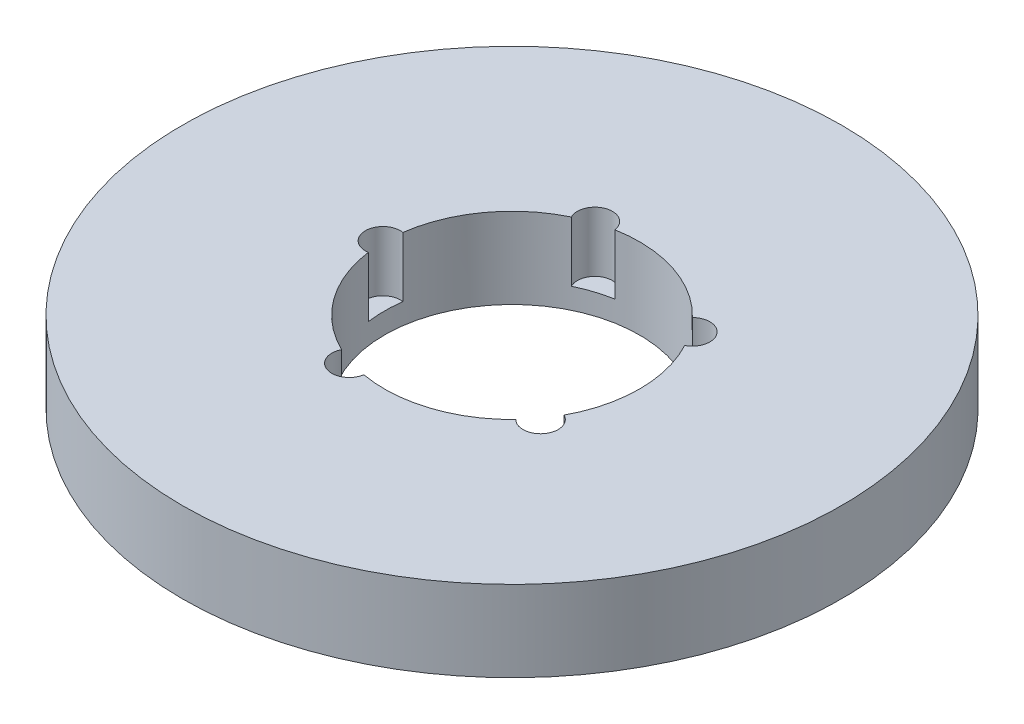
ISO-10303-21;
HEADER;
FILE_DESCRIPTION(('STEP AP214'),'2;1');
FILE_NAME('part.step','',(''),(''),'','','');
FILE_SCHEMA(('AUTOMOTIVE_DESIGN { 1 0 10303 214 1 1 1 1 }'));
ENDSEC;
DATA;
#1=APPLICATION_CONTEXT('core data for automotive mechanical design processes');
#2=APPLICATION_PROTOCOL_DEFINITION('international standard','automotive_design',2000,#1);
#3=PRODUCT_CONTEXT('',#1,'mechanical');
#4=PRODUCT('Part','Part','',(#3));
#5=PRODUCT_RELATED_PRODUCT_CATEGORY('part','',(#4));
#6=PRODUCT_DEFINITION_FORMATION('','',#4);
#7=PRODUCT_DEFINITION_CONTEXT('part definition',#1,'design');
#8=PRODUCT_DEFINITION('design','',#6,#7);
#9=PRODUCT_DEFINITION_SHAPE('','',#8);
#10=(LENGTH_UNIT() NAMED_UNIT(*) SI_UNIT(.MILLI.,.METRE.));
#11=(NAMED_UNIT(*) PLANE_ANGLE_UNIT() SI_UNIT($,.RADIAN.));
#12=(NAMED_UNIT(*) SI_UNIT($,.STERADIAN.) SOLID_ANGLE_UNIT());
#13=UNCERTAINTY_MEASURE_WITH_UNIT(LENGTH_MEASURE(1.E-05),#10,'distance_accuracy_value','');
#14=(GEOMETRIC_REPRESENTATION_CONTEXT(3) GLOBAL_UNCERTAINTY_ASSIGNED_CONTEXT((#13)) GLOBAL_UNIT_ASSIGNED_CONTEXT((#10,
#11,#12)) REPRESENTATION_CONTEXT('',''));
#15=CARTESIAN_POINT('',(0.,0.,0.));
#16=DIRECTION('',(0.,0.,1.));
#17=DIRECTION('',(1.,0.,0.));
#18=AXIS2_PLACEMENT_3D('',#15,#16,#17);
#19=CARTESIAN_POINT('',(0.,19.,0.));
#20=DIRECTION('',(0.,-1.,0.));
#21=DIRECTION('',(0.,0.,-1.));
#22=AXIS2_PLACEMENT_3D('',#19,#20,#21);
#23=CYLINDRICAL_SURFACE('',#22,77.5);
#24=CARTESIAN_POINT('',(0.,19.,0.));
#25=DIRECTION('',(0.,1.,0.));
#26=DIRECTION('',(0.,0.,1.));
#27=AXIS2_PLACEMENT_3D('',#24,#25,#26);
#28=CIRCLE('',#27,77.5);
#29=CARTESIAN_POINT('',(0.,19.,77.5));
#30=VERTEX_POINT('',#29);
#31=EDGE_CURVE('E160',#30,#30,#28,.T.);
#32=ORIENTED_EDGE('',*,*,#31,.F.);
#33=EDGE_LOOP('',(#32));
#34=FACE_BOUND('',#33,.T.);
#35=CARTESIAN_POINT('',(0.,0.,0.));
#36=DIRECTION('',(0.,1.,0.));
#37=DIRECTION('',(0.,0.,1.));
#38=AXIS2_PLACEMENT_3D('',#35,#36,#37);
#39=CIRCLE('',#38,77.5);
#40=CARTESIAN_POINT('',(0.,0.,77.5));
#41=VERTEX_POINT('',#40);
#42=EDGE_CURVE('E153',#41,#41,#39,.T.);
#43=ORIENTED_EDGE('',*,*,#42,.T.);
#44=EDGE_LOOP('',(#43));
#45=FACE_BOUND('',#44,.T.);
#46=ADVANCED_FACE('F39',(#34,#45),#23,.T.);
#47=CARTESIAN_POINT('',(0.,19.,0.));
#48=DIRECTION('',(0.,1.,0.));
#49=DIRECTION('',(0.,0.,1.));
#50=AXIS2_PLACEMENT_3D('',#47,#48,#49);
#51=PLANE('',#50);
#52=CARTESIAN_POINT('',(-9.3824829116188,19.,28.8763131949176));
#53=DIRECTION('',(0.,1.,0.));
#54=DIRECTION('',(0.951056516295155,0.,0.309016994374945));
#55=AXIS2_PLACEMENT_3D('',#52,#53,#54);
#56=CIRCLE('',#55,4.11929126151412);
#57=CARTESIAN_POINT('',(-13.0549902183955,19.,27.0105022240905));
#58=VERTEX_POINT('',#57);
#59=CARTESIAN_POINT('',(-5.31466591625265,19.,29.5254860450869));
#60=VERTEX_POINT('',#59);
#61=EDGE_CURVE('E186',#58,#60,#56,.T.);
#62=ORIENTED_EDGE('',*,*,#61,.F.);
#63=CARTESIAN_POINT('',(0.,19.,0.));
#64=DIRECTION('',(0.,1.,0.));
#65=DIRECTION('',(0.,0.,1.));
#66=AXIS2_PLACEMENT_3D('',#63,#64,#65);
#67=CIRCLE('',#66,30.);
#68=CARTESIAN_POINT('',(-29.7227279875089,19.,4.06932930352829));
#69=VERTEX_POINT('',#68);
#70=EDGE_CURVE('E148',#69,#58,#67,.T.);
#71=ORIENTED_EDGE('',*,*,#70,.F.);
#72=CARTESIAN_POINT('',(-30.3623524997288,19.,0.));
#73=DIRECTION('',(0.,1.,0.));
#74=DIRECTION('',(0.,0.,1.));
#75=AXIS2_PLACEMENT_3D('',#72,#73,#74);
#76=CIRCLE('',#75,4.11929126151412);
#77=CARTESIAN_POINT('',(-29.7227279875089,19.,-4.06932930352829));
#78=VERTEX_POINT('',#77);
#79=EDGE_CURVE('E142',#78,#69,#76,.T.);
#80=ORIENTED_EDGE('',*,*,#79,.F.);
#81=CARTESIAN_POINT('',(-13.0549902183958,19.,-27.0105022240903));
#82=VERTEX_POINT('',#81);
#83=EDGE_CURVE('E132',#82,#78,#67,.T.);
#84=ORIENTED_EDGE('',*,*,#83,.F.);
#85=CARTESIAN_POINT('',(-9.3824829116192,19.,-28.8763131949174));
#86=DIRECTION('',(0.,1.,0.));
#87=DIRECTION('',(-0.95105651629515,0.,0.309016994374958));
#88=AXIS2_PLACEMENT_3D('',#85,#86,#87);
#89=CIRCLE('',#88,4.11929126151412);
#90=CARTESIAN_POINT('',(-5.31466591625307,19.,-29.5254860450868));
#91=VERTEX_POINT('',#90);
#92=EDGE_CURVE('E111',#91,#82,#89,.T.);
#93=ORIENTED_EDGE('',*,*,#92,.F.);
#94=CARTESIAN_POINT('',(21.6543003097429,19.,-20.762737731221));
#95=VERTEX_POINT('',#94);
#96=EDGE_CURVE('E141',#95,#91,#67,.T.);
#97=ORIENTED_EDGE('',*,*,#96,.F.);
#98=CARTESIAN_POINT('',(24.5636591614831,19.,-17.8465430242463));
#99=DIRECTION('',(0.,1.,0.));
#100=DIRECTION('',(-0.58778525229248,0.,-0.809016994374942));
#101=AXIS2_PLACEMENT_3D('',#98,#99,#100);
#102=CIRCLE('',#101,4.11929126151412);
#103=CARTESIAN_POINT('',(26.438083812414,19.,-14.1784246066964));
#104=VERTEX_POINT('',#103);
#105=EDGE_CURVE('E173',#104,#95,#102,.T.);
#106=ORIENTED_EDGE('',*,*,#105,.F.);
#107=CARTESIAN_POINT('',(26.4380838124142,19.,14.178424606696));
#108=VERTEX_POINT('',#107);
#109=EDGE_CURVE('E150',#108,#104,#67,.T.);
#110=ORIENTED_EDGE('',*,*,#109,.F.);
#111=CARTESIAN_POINT('',(24.5636591614834,19.,17.846543024246));
#112=DIRECTION('',(0.,1.,0.));
#113=DIRECTION('',(0.587785252292469,0.,-0.809016994374951));
#114=AXIS2_PLACEMENT_3D('',#111,#112,#113);
#115=CIRCLE('',#114,4.11929126151412);
#116=CARTESIAN_POINT('',(21.6543003097432,19.,20.7627377312207));
#117=VERTEX_POINT('',#116);
#118=EDGE_CURVE('E172',#117,#108,#115,.T.);
#119=ORIENTED_EDGE('',*,*,#118,.F.);
#120=EDGE_CURVE('E152',#60,#117,#67,.T.);
#121=ORIENTED_EDGE('',*,*,#120,.F.);
#122=EDGE_LOOP('',(#62,#71,#80,#84,#93,#97,#106,#110,#119,#121));
#123=FACE_BOUND('',#122,.T.);
#124=ORIENTED_EDGE('',*,*,#31,.T.);
#125=EDGE_LOOP('',(#124));
#126=FACE_BOUND('',#125,.T.);
#127=ADVANCED_FACE('F138',(#123,#126),#51,.T.);
#128=CARTESIAN_POINT('',(0.,0.,0.));
#129=DIRECTION('',(0.,1.,0.));
#130=DIRECTION('',(0.,0.,1.));
#131=AXIS2_PLACEMENT_3D('',#128,#129,#130);
#132=PLANE('',#131);
#133=CARTESIAN_POINT('',(0.,0.,0.));
#134=DIRECTION('',(0.,1.,0.));
#135=DIRECTION('',(0.,0.,1.));
#136=AXIS2_PLACEMENT_3D('',#133,#134,#135);
#137=CIRCLE('',#136,30.);
#138=CARTESIAN_POINT('',(0.,0.,30.));
#139=VERTEX_POINT('',#138);
#140=EDGE_CURVE('E145',#139,#139,#137,.T.);
#141=ORIENTED_EDGE('',*,*,#140,.T.);
#142=EDGE_LOOP('',(#141));
#143=FACE_BOUND('',#142,.T.);
#144=ORIENTED_EDGE('',*,*,#42,.F.);
#145=EDGE_LOOP('',(#144));
#146=FACE_BOUND('',#145,.T.);
#147=ADVANCED_FACE('F216',(#143,#146),#132,.F.);
#148=CARTESIAN_POINT('',(0.,19.,0.));
#149=DIRECTION('',(0.,-1.,0.));
#150=DIRECTION('',(0.,0.,-1.));
#151=AXIS2_PLACEMENT_3D('',#148,#149,#150);
#152=CYLINDRICAL_SURFACE('',#151,30.);
#153=DIRECTION('',(0.,1.,0.));
#154=VECTOR('',#153,1.);
#155=CARTESIAN_POINT('',(-13.0549902183955,11.9491792218147,27.0105022240905));
#156=LINE('',#155,#154);
#157=CARTESIAN_POINT('',(-13.0549902183955,4.8983584436294,27.0105022240905));
#158=VERTEX_POINT('',#157);
#159=EDGE_CURVE('E11',#158,#58,#156,.T.);
#160=ORIENTED_EDGE('',*,*,#159,.F.);
#161=CARTESIAN_POINT('',(0.,4.8983584436294,0.));
#162=DIRECTION('',(0.,1.,0.));
#163=DIRECTION('',(0.,0.,1.));
#164=AXIS2_PLACEMENT_3D('',#161,#162,#163);
#165=CIRCLE('',#164,30.);
#166=CARTESIAN_POINT('',(-5.31466591625265,4.8983584436294,29.5254860450869));
#167=VERTEX_POINT('',#166);
#168=EDGE_CURVE('E192',#158,#167,#165,.T.);
#169=ORIENTED_EDGE('',*,*,#168,.T.);
#170=DIRECTION('',(0.,1.,0.));
#171=VECTOR('',#170,1.);
#172=CARTESIAN_POINT('',(-5.31466591625265,11.9491792218147,29.5254860450869));
#173=LINE('',#172,#171);
#174=EDGE_CURVE('E46',#60,#167,#173,.F.);
#175=ORIENTED_EDGE('',*,*,#174,.F.);
#176=ORIENTED_EDGE('',*,*,#120,.T.);
#177=DIRECTION('',(0.,1.,0.));
#178=VECTOR('',#177,1.);
#179=CARTESIAN_POINT('',(21.6543003097432,11.9491792218147,20.7627377312207));
#180=LINE('',#179,#178);
#181=CARTESIAN_POINT('',(21.6543003097432,4.8983584436294,20.7627377312207));
#182=VERTEX_POINT('',#181);
#183=EDGE_CURVE('E195',#182,#117,#180,.T.);
#184=ORIENTED_EDGE('',*,*,#183,.F.);
#185=CARTESIAN_POINT('',(0.,4.8983584436294,0.));
#186=DIRECTION('',(0.,1.,0.));
#187=DIRECTION('',(0.,0.,1.));
#188=AXIS2_PLACEMENT_3D('',#185,#186,#187);
#189=CIRCLE('',#188,30.);
#190=CARTESIAN_POINT('',(26.4380838124142,4.8983584436294,14.178424606696));
#191=VERTEX_POINT('',#190);
#192=EDGE_CURVE('E197',#182,#191,#189,.T.);
#193=ORIENTED_EDGE('',*,*,#192,.T.);
#194=DIRECTION('',(0.,1.,0.));
#195=VECTOR('',#194,1.);
#196=CARTESIAN_POINT('',(26.4380838124142,11.9491792218147,14.178424606696));
#197=LINE('',#196,#195);
#198=EDGE_CURVE('E168',#108,#191,#197,.F.);
#199=ORIENTED_EDGE('',*,*,#198,.F.);
#200=ORIENTED_EDGE('',*,*,#109,.T.);
#201=DIRECTION('',(0.,1.,0.));
#202=VECTOR('',#201,1.);
#203=CARTESIAN_POINT('',(26.438083812414,11.9491792218147,-14.1784246066964));
#204=LINE('',#203,#202);
#205=CARTESIAN_POINT('',(26.438083812414,4.8983584436294,-14.1784246066964));
#206=VERTEX_POINT('',#205);
#207=EDGE_CURVE('E169',#206,#104,#204,.T.);
#208=ORIENTED_EDGE('',*,*,#207,.F.);
#209=CARTESIAN_POINT('',(0.,4.8983584436294,0.));
#210=DIRECTION('',(0.,1.,0.));
#211=DIRECTION('',(0.,0.,1.));
#212=AXIS2_PLACEMENT_3D('',#209,#210,#211);
#213=CIRCLE('',#212,30.);
#214=CARTESIAN_POINT('',(21.6543003097429,4.8983584436294,-20.762737731221));
#215=VERTEX_POINT('',#214);
#216=EDGE_CURVE('E332',#206,#215,#213,.T.);
#217=ORIENTED_EDGE('',*,*,#216,.T.);
#218=DIRECTION('',(0.,1.,0.));
#219=VECTOR('',#218,1.);
#220=CARTESIAN_POINT('',(21.6543003097429,11.9491792218147,-20.762737731221));
#221=LINE('',#220,#219);
#222=EDGE_CURVE('E335',#95,#215,#221,.F.);
#223=ORIENTED_EDGE('',*,*,#222,.F.);
#224=ORIENTED_EDGE('',*,*,#96,.T.);
#225=DIRECTION('',(0.,1.,0.));
#226=VECTOR('',#225,1.);
#227=CARTESIAN_POINT('',(-5.31466591625307,11.9491792218147,-29.5254860450868));
#228=LINE('',#227,#226);
#229=CARTESIAN_POINT('',(-5.31466591625307,4.8983584436294,-29.5254860450868));
#230=VERTEX_POINT('',#229);
#231=EDGE_CURVE('E121',#230,#91,#228,.T.);
#232=ORIENTED_EDGE('',*,*,#231,.F.);
#233=CARTESIAN_POINT('',(0.,4.8983584436294,0.));
#234=DIRECTION('',(0.,1.,0.));
#235=DIRECTION('',(0.,0.,1.));
#236=AXIS2_PLACEMENT_3D('',#233,#234,#235);
#237=CIRCLE('',#236,30.);
#238=CARTESIAN_POINT('',(-13.0549902183958,4.8983584436294,-27.0105022240903));
#239=VERTEX_POINT('',#238);
#240=EDGE_CURVE('E134',#230,#239,#237,.T.);
#241=ORIENTED_EDGE('',*,*,#240,.T.);
#242=DIRECTION('',(0.,1.,0.));
#243=VECTOR('',#242,1.);
#244=CARTESIAN_POINT('',(-13.0549902183958,11.9491792218147,-27.0105022240903));
#245=LINE('',#244,#243);
#246=EDGE_CURVE('E117',#82,#239,#245,.F.);
#247=ORIENTED_EDGE('',*,*,#246,.F.);
#248=ORIENTED_EDGE('',*,*,#83,.T.);
#249=DIRECTION('',(0.,1.,0.));
#250=VECTOR('',#249,1.);
#251=CARTESIAN_POINT('',(-29.7227279875089,11.9491792218147,-4.06932930352829));
#252=LINE('',#251,#250);
#253=CARTESIAN_POINT('',(-29.7227279875089,4.8983584436294,-4.06932930352829));
#254=VERTEX_POINT('',#253);
#255=EDGE_CURVE('E338',#254,#78,#252,.T.);
#256=ORIENTED_EDGE('',*,*,#255,.F.);
#257=CARTESIAN_POINT('',(0.,4.8983584436294,0.));
#258=DIRECTION('',(0.,1.,0.));
#259=DIRECTION('',(0.,0.,1.));
#260=AXIS2_PLACEMENT_3D('',#257,#258,#259);
#261=CIRCLE('',#260,30.);
#262=CARTESIAN_POINT('',(-29.7227279875089,4.8983584436294,4.06932930352829));
#263=VERTEX_POINT('',#262);
#264=EDGE_CURVE('E342',#254,#263,#261,.T.);
#265=ORIENTED_EDGE('',*,*,#264,.T.);
#266=DIRECTION('',(0.,1.,0.));
#267=VECTOR('',#266,1.);
#268=CARTESIAN_POINT('',(-29.7227279875089,11.9491792218147,4.06932930352829));
#269=LINE('',#268,#267);
#270=EDGE_CURVE('E341',#69,#263,#269,.F.);
#271=ORIENTED_EDGE('',*,*,#270,.F.);
#272=ORIENTED_EDGE('',*,*,#70,.T.);
#273=EDGE_LOOP('',(#160,#169,#175,#176,#184,#193,#199,#200,#208,#217,#223,#224,#232,#241,#247,
#248,#256,#265,#271,#272));
#274=FACE_BOUND('',#273,.T.);
#275=ORIENTED_EDGE('',*,*,#140,.F.);
#276=EDGE_LOOP('',(#275));
#277=FACE_BOUND('',#276,.T.);
#278=ADVANCED_FACE('F128',(#274,#277),#152,.F.);
#279=CARTESIAN_POINT('',(-30.3623524997288,4.8983584436294,0.));
#280=DIRECTION('',(0.,1.,0.));
#281=DIRECTION('',(0.,0.,1.));
#282=AXIS2_PLACEMENT_3D('',#279,#280,#281);
#283=CYLINDRICAL_SURFACE('',#282,4.11929126151412);
#284=ORIENTED_EDGE('',*,*,#255,.T.);
#285=ORIENTED_EDGE('',*,*,#79,.T.);
#286=ORIENTED_EDGE('',*,*,#270,.T.);
#287=CARTESIAN_POINT('',(-30.3623524997288,4.8983584436294,0.));
#288=DIRECTION('',(0.,1.,0.));
#289=DIRECTION('',(0.,0.,1.));
#290=AXIS2_PLACEMENT_3D('',#287,#288,#289);
#291=CIRCLE('',#290,4.11929126151412);
#292=EDGE_CURVE('E149',#254,#263,#291,.T.);
#293=ORIENTED_EDGE('',*,*,#292,.F.);
#294=EDGE_LOOP('',(#284,#285,#286,#293));
#295=FACE_BOUND('',#294,.T.);
#296=ADVANCED_FACE('F227',(#295),#283,.F.);
#297=CARTESIAN_POINT('',(-30.3623524997288,4.8983584436294,0.));
#298=DIRECTION('',(0.,1.,0.));
#299=DIRECTION('',(0.,0.,1.));
#300=AXIS2_PLACEMENT_3D('',#297,#298,#299);
#301=PLANE('',#300);
#302=ORIENTED_EDGE('',*,*,#292,.T.);
#303=ORIENTED_EDGE('',*,*,#264,.F.);
#304=EDGE_LOOP('',(#302,#303));
#305=FACE_BOUND('',#304,.T.);
#306=ADVANCED_FACE('F235',(#305),#301,.T.);
#307=CARTESIAN_POINT('',(-9.3824829116192,4.8983584436294,-28.8763131949174));
#308=DIRECTION('',(0.,1.,0.));
#309=DIRECTION('',(0.,0.,1.));
#310=AXIS2_PLACEMENT_3D('',#307,#308,#309);
#311=CYLINDRICAL_SURFACE('',#310,4.11929126151412);
#312=ORIENTED_EDGE('',*,*,#231,.T.);
#313=ORIENTED_EDGE('',*,*,#92,.T.);
#314=ORIENTED_EDGE('',*,*,#246,.T.);
#315=CARTESIAN_POINT('',(-9.3824829116192,4.8983584436294,-28.8763131949174));
#316=DIRECTION('',(0.,1.,0.));
#317=DIRECTION('',(-0.95105651629515,0.,0.309016994374958));
#318=AXIS2_PLACEMENT_3D('',#315,#316,#317);
#319=CIRCLE('',#318,4.11929126151412);
#320=EDGE_CURVE('E127',#230,#239,#319,.T.);
#321=ORIENTED_EDGE('',*,*,#320,.F.);
#322=EDGE_LOOP('',(#312,#313,#314,#321));
#323=FACE_BOUND('',#322,.T.);
#324=ADVANCED_FACE('F116',(#323),#311,.F.);
#325=CARTESIAN_POINT('',(-9.3824829116192,4.8983584436294,-28.8763131949174));
#326=DIRECTION('',(0.,1.,0.));
#327=DIRECTION('',(-0.95105651629515,0.,0.309016994374958));
#328=AXIS2_PLACEMENT_3D('',#325,#326,#327);
#329=PLANE('',#328);
#330=ORIENTED_EDGE('',*,*,#320,.T.);
#331=ORIENTED_EDGE('',*,*,#240,.F.);
#332=EDGE_LOOP('',(#330,#331));
#333=FACE_BOUND('',#332,.T.);
#334=ADVANCED_FACE('F236',(#333),#329,.T.);
#335=CARTESIAN_POINT('',(24.5636591614831,4.8983584436294,-17.8465430242463));
#336=DIRECTION('',(0.,1.,0.));
#337=DIRECTION('',(0.,0.,1.));
#338=AXIS2_PLACEMENT_3D('',#335,#336,#337);
#339=CYLINDRICAL_SURFACE('',#338,4.11929126151412);
#340=ORIENTED_EDGE('',*,*,#207,.T.);
#341=ORIENTED_EDGE('',*,*,#105,.T.);
#342=ORIENTED_EDGE('',*,*,#222,.T.);
#343=CARTESIAN_POINT('',(24.5636591614831,4.8983584436294,-17.8465430242463));
#344=DIRECTION('',(0.,1.,0.));
#345=DIRECTION('',(-0.58778525229248,0.,-0.809016994374942));
#346=AXIS2_PLACEMENT_3D('',#343,#344,#345);
#347=CIRCLE('',#346,4.11929126151412);
#348=EDGE_CURVE('E177',#206,#215,#347,.T.);
#349=ORIENTED_EDGE('',*,*,#348,.F.);
#350=EDGE_LOOP('',(#340,#341,#342,#349));
#351=FACE_BOUND('',#350,.T.);
#352=ADVANCED_FACE('F241',(#351),#339,.F.);
#353=CARTESIAN_POINT('',(24.5636591614831,4.8983584436294,-17.8465430242463));
#354=DIRECTION('',(0.,1.,0.));
#355=DIRECTION('',(-0.58778525229248,0.,-0.809016994374942));
#356=AXIS2_PLACEMENT_3D('',#353,#354,#355);
#357=PLANE('',#356);
#358=ORIENTED_EDGE('',*,*,#348,.T.);
#359=ORIENTED_EDGE('',*,*,#216,.F.);
#360=EDGE_LOOP('',(#358,#359));
#361=FACE_BOUND('',#360,.T.);
#362=ADVANCED_FACE('F244',(#361),#357,.T.);
#363=CARTESIAN_POINT('',(24.5636591614834,4.8983584436294,17.846543024246));
#364=DIRECTION('',(0.,1.,0.));
#365=DIRECTION('',(0.,0.,1.));
#366=AXIS2_PLACEMENT_3D('',#363,#364,#365);
#367=CYLINDRICAL_SURFACE('',#366,4.11929126151412);
#368=ORIENTED_EDGE('',*,*,#183,.T.);
#369=ORIENTED_EDGE('',*,*,#118,.T.);
#370=ORIENTED_EDGE('',*,*,#198,.T.);
#371=CARTESIAN_POINT('',(24.5636591614834,4.8983584436294,17.846543024246));
#372=DIRECTION('',(0.,1.,0.));
#373=DIRECTION('',(0.587785252292469,0.,-0.809016994374951));
#374=AXIS2_PLACEMENT_3D('',#371,#372,#373);
#375=CIRCLE('',#374,4.11929126151412);
#376=EDGE_CURVE('E56',#182,#191,#375,.T.);
#377=ORIENTED_EDGE('',*,*,#376,.F.);
#378=EDGE_LOOP('',(#368,#369,#370,#377));
#379=FACE_BOUND('',#378,.T.);
#380=ADVANCED_FACE('F191',(#379),#367,.F.);
#381=CARTESIAN_POINT('',(24.5636591614834,4.8983584436294,17.846543024246));
#382=DIRECTION('',(0.,1.,0.));
#383=DIRECTION('',(0.587785252292469,0.,-0.809016994374951));
#384=AXIS2_PLACEMENT_3D('',#381,#382,#383);
#385=PLANE('',#384);
#386=ORIENTED_EDGE('',*,*,#376,.T.);
#387=ORIENTED_EDGE('',*,*,#192,.F.);
#388=EDGE_LOOP('',(#386,#387));
#389=FACE_BOUND('',#388,.T.);
#390=ADVANCED_FACE('F208',(#389),#385,.T.);
#391=CARTESIAN_POINT('',(-9.3824829116188,4.8983584436294,28.8763131949176));
#392=DIRECTION('',(0.,1.,0.));
#393=DIRECTION('',(0.,0.,1.));
#394=AXIS2_PLACEMENT_3D('',#391,#392,#393);
#395=CYLINDRICAL_SURFACE('',#394,4.11929126151412);
#396=ORIENTED_EDGE('',*,*,#159,.T.);
#397=ORIENTED_EDGE('',*,*,#61,.T.);
#398=ORIENTED_EDGE('',*,*,#174,.T.);
#399=CARTESIAN_POINT('',(-9.3824829116188,4.8983584436294,28.8763131949176));
#400=DIRECTION('',(0.,1.,0.));
#401=DIRECTION('',(0.951056516295155,0.,0.309016994374945));
#402=AXIS2_PLACEMENT_3D('',#399,#400,#401);
#403=CIRCLE('',#402,4.11929126151412);
#404=EDGE_CURVE('E55',#158,#167,#403,.T.);
#405=ORIENTED_EDGE('',*,*,#404,.F.);
#406=EDGE_LOOP('',(#396,#397,#398,#405));
#407=FACE_BOUND('',#406,.T.);
#408=ADVANCED_FACE('F203',(#407),#395,.F.);
#409=CARTESIAN_POINT('',(-9.3824829116188,4.8983584436294,28.8763131949176));
#410=DIRECTION('',(0.,1.,0.));
#411=DIRECTION('',(0.951056516295155,0.,0.309016994374945));
#412=AXIS2_PLACEMENT_3D('',#409,#410,#411);
#413=PLANE('',#412);
#414=ORIENTED_EDGE('',*,*,#404,.T.);
#415=ORIENTED_EDGE('',*,*,#168,.F.);
#416=EDGE_LOOP('',(#414,#415));
#417=FACE_BOUND('',#416,.T.);
#418=ADVANCED_FACE('F205',(#417),#413,.T.);
#419=CLOSED_SHELL('',(#46,#127,#147,#278,#296,#306,#324,#334,#352,#362,#380,#390,#408,#418));
#420=MANIFOLD_SOLID_BREP('B2',#419);
#421=ADVANCED_BREP_SHAPE_REPRESENTATION('',(#18,#420),#14);
#422=SHAPE_DEFINITION_REPRESENTATION(#9,#421);
ENDSEC;
END-ISO-10303-21;
